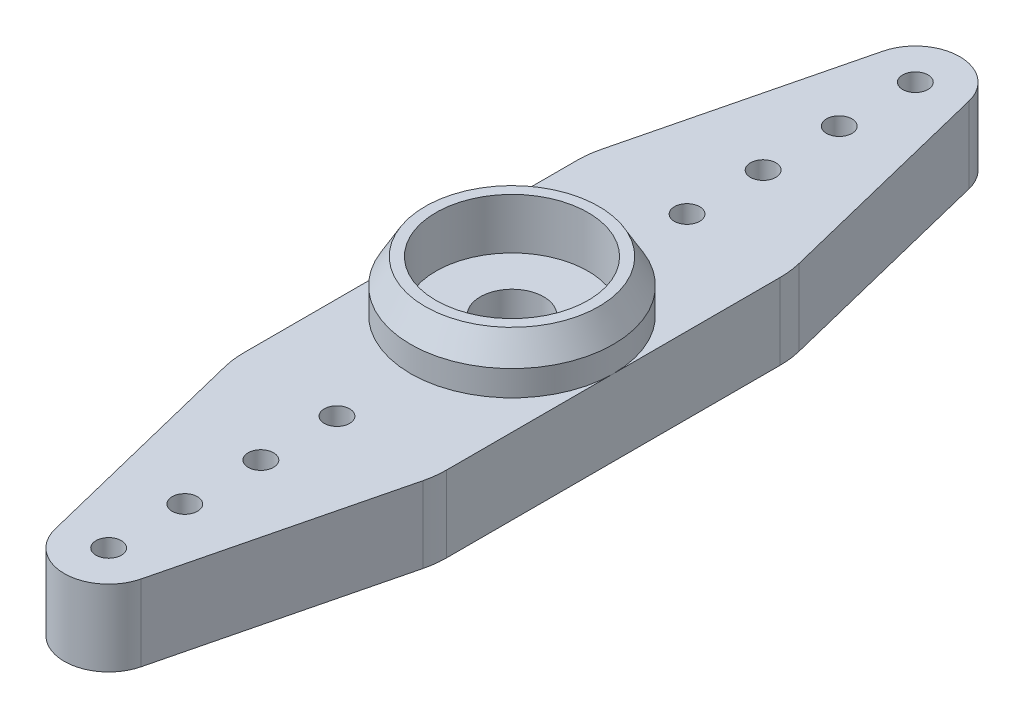
ISO-10303-21;
HEADER;
FILE_DESCRIPTION(('STEP AP214'),'2;1');
FILE_NAME('part.step','',(''),(''),'','','');
FILE_SCHEMA(('AUTOMOTIVE_DESIGN { 1 0 10303 214 1 1 1 1 }'));
ENDSEC;
DATA;
#1=APPLICATION_CONTEXT('core data for automotive mechanical design processes');
#2=APPLICATION_PROTOCOL_DEFINITION('international standard','automotive_design',2000,#1);
#3=PRODUCT_CONTEXT('',#1,'mechanical');
#4=PRODUCT('Part','Part','',(#3));
#5=PRODUCT_RELATED_PRODUCT_CATEGORY('part','',(#4));
#6=PRODUCT_DEFINITION_FORMATION('','',#4);
#7=PRODUCT_DEFINITION_CONTEXT('part definition',#1,'design');
#8=PRODUCT_DEFINITION('design','',#6,#7);
#9=PRODUCT_DEFINITION_SHAPE('','',#8);
#10=(LENGTH_UNIT() NAMED_UNIT(*) SI_UNIT(.MILLI.,.METRE.));
#11=(NAMED_UNIT(*) PLANE_ANGLE_UNIT() SI_UNIT($,.RADIAN.));
#12=(NAMED_UNIT(*) SI_UNIT($,.STERADIAN.) SOLID_ANGLE_UNIT());
#13=UNCERTAINTY_MEASURE_WITH_UNIT(LENGTH_MEASURE(1.E-05),#10,'distance_accuracy_value','');
#14=(GEOMETRIC_REPRESENTATION_CONTEXT(3) GLOBAL_UNCERTAINTY_ASSIGNED_CONTEXT((#13)) GLOBAL_UNIT_ASSIGNED_CONTEXT((#10,
#11,#12)) REPRESENTATION_CONTEXT('',''));
#15=CARTESIAN_POINT('',(0.,0.,0.));
#16=DIRECTION('',(0.,0.,1.));
#17=DIRECTION('',(1.,0.,0.));
#18=AXIS2_PLACEMENT_3D('',#15,#16,#17);
#19=CARTESIAN_POINT('',(0.,3.,0.));
#20=DIRECTION('',(0.,1.,0.));
#21=DIRECTION('',(0.,0.,1.));
#22=AXIS2_PLACEMENT_3D('',#19,#20,#21);
#23=PLANE('',#22);
#24=CARTESIAN_POINT('',(0.,3.,0.));
#25=DIRECTION('',(0.,1.,0.));
#26=DIRECTION('',(0.,0.,1.));
#27=AXIS2_PLACEMENT_3D('',#24,#25,#26);
#28=CIRCLE('',#27,4.);
#29=CARTESIAN_POINT('',(4.,3.,0.));
#30=VERTEX_POINT('',#29);
#31=CARTESIAN_POINT('',(-4.,3.,0.));
#32=VERTEX_POINT('',#31);
#33=EDGE_CURVE('E166',#30,#32,#28,.T.);
#34=ORIENTED_EDGE('',*,*,#33,.F.);
#35=DIRECTION('',(0.,0.,-1.));
#36=VECTOR('',#35,1.);
#37=CARTESIAN_POINT('',(4.,3.,-6.57429368146869));
#38=LINE('',#37,#36);
#39=CARTESIAN_POINT('',(4.,3.,-6.57429368146869));
#40=VERTEX_POINT('',#39);
#41=EDGE_CURVE('E94',#30,#40,#38,.T.);
#42=ORIENTED_EDGE('',*,*,#41,.T.);
#43=CARTESIAN_POINT('',(0.5,3.,-6.57429368146869));
#44=DIRECTION('',(0.,1.,0.));
#45=DIRECTION('',(0.,0.,-1.));
#46=AXIS2_PLACEMENT_3D('',#43,#44,#45);
#47=CIRCLE('',#46,3.5);
#48=CARTESIAN_POINT('',(3.89795205229431,3.,-7.41329418820803));
#49=VERTEX_POINT('',#48);
#50=EDGE_CURVE('E320',#40,#49,#47,.T.);
#51=ORIENTED_EDGE('',*,*,#50,.T.);
#52=DIRECTION('',(-0.239714430496953,0.,-0.970843443512661));
#53=VECTOR('',#52,1.);
#54=CARTESIAN_POINT('',(1.69897602614716,3.,-16.319147094104));
#55=LINE('',#54,#53);
#56=CARTESIAN_POINT('',(1.69897602614716,3.,-16.319147094104));
#57=VERTEX_POINT('',#56);
#58=EDGE_CURVE('E112',#49,#57,#55,.T.);
#59=ORIENTED_EDGE('',*,*,#58,.T.);
#60=CARTESIAN_POINT('',(0.,3.,-15.8996468407343));
#61=DIRECTION('',(0.,1.,0.));
#62=DIRECTION('',(0.,0.,-1.));
#63=AXIS2_PLACEMENT_3D('',#60,#61,#62);
#64=CIRCLE('',#63,1.75);
#65=CARTESIAN_POINT('',(-1.69897602614716,3.,-16.319147094104));
#66=VERTEX_POINT('',#65);
#67=EDGE_CURVE('E105',#57,#66,#64,.T.);
#68=ORIENTED_EDGE('',*,*,#67,.T.);
#69=DIRECTION('',(-0.239714430496953,0.,0.970843443512661));
#70=VECTOR('',#69,1.);
#71=CARTESIAN_POINT('',(-3.89795205229431,3.,-7.41329418820803));
#72=LINE('',#71,#70);
#73=CARTESIAN_POINT('',(-3.89795205229431,3.,-7.41329418820803));
#74=VERTEX_POINT('',#73);
#75=EDGE_CURVE('E109',#66,#74,#72,.T.);
#76=ORIENTED_EDGE('',*,*,#75,.T.);
#77=CARTESIAN_POINT('',(-0.5,3.,-6.57429368146869));
#78=DIRECTION('',(0.,1.,0.));
#79=DIRECTION('',(0.,0.,-1.));
#80=AXIS2_PLACEMENT_3D('',#77,#78,#79);
#81=CIRCLE('',#80,3.5);
#82=CARTESIAN_POINT('',(-4.,3.,-6.57429368146869));
#83=VERTEX_POINT('',#82);
#84=EDGE_CURVE('E59',#74,#83,#81,.T.);
#85=ORIENTED_EDGE('',*,*,#84,.T.);
#86=DIRECTION('',(0.,0.,1.));
#87=VECTOR('',#86,1.);
#88=CARTESIAN_POINT('',(-4.,3.,0.));
#89=LINE('',#88,#87);
#90=EDGE_CURVE('E133',#83,#32,#89,.T.);
#91=ORIENTED_EDGE('',*,*,#90,.T.);
#92=EDGE_LOOP('',(#34,#42,#51,#59,#68,#76,#85,#91));
#93=FACE_BOUND('',#92,.T.);
#94=CARTESIAN_POINT('',(0.,3.,-6.89964684073435));
#95=DIRECTION('',(0.,1.,0.));
#96=DIRECTION('',(0.,0.,1.));
#97=AXIS2_PLACEMENT_3D('',#94,#95,#96);
#98=CIRCLE('',#97,0.500000000000001);
#99=CARTESIAN_POINT('',(0.,3.,-6.39964684073434));
#100=VERTEX_POINT('',#99);
#101=EDGE_CURVE('E294',#100,#100,#98,.T.);
#102=ORIENTED_EDGE('',*,*,#101,.F.);
#103=EDGE_LOOP('',(#102));
#104=FACE_BOUND('',#103,.T.);
#105=CARTESIAN_POINT('',(0.,3.,-12.8996468407343));
#106=DIRECTION('',(0.,1.,0.));
#107=DIRECTION('',(0.,0.,1.));
#108=AXIS2_PLACEMENT_3D('',#105,#106,#107);
#109=CIRCLE('',#108,0.500000000000001);
#110=CARTESIAN_POINT('',(0.,3.,-12.3996468407343));
#111=VERTEX_POINT('',#110);
#112=EDGE_CURVE('E306',#111,#111,#109,.T.);
#113=ORIENTED_EDGE('',*,*,#112,.F.);
#114=EDGE_LOOP('',(#113));
#115=FACE_BOUND('',#114,.T.);
#116=CARTESIAN_POINT('',(0.,3.,-15.8996468407343));
#117=DIRECTION('',(0.,1.,0.));
#118=DIRECTION('',(0.,0.,1.));
#119=AXIS2_PLACEMENT_3D('',#116,#117,#118);
#120=CIRCLE('',#119,0.500000000000001);
#121=CARTESIAN_POINT('',(0.,3.,-15.3996468407343));
#122=VERTEX_POINT('',#121);
#123=EDGE_CURVE('E140',#122,#122,#120,.T.);
#124=ORIENTED_EDGE('',*,*,#123,.F.);
#125=EDGE_LOOP('',(#124));
#126=FACE_BOUND('',#125,.T.);
#127=CARTESIAN_POINT('',(0.,3.,-9.89964684073435));
#128=DIRECTION('',(0.,1.,0.));
#129=DIRECTION('',(0.,0.,1.));
#130=AXIS2_PLACEMENT_3D('',#127,#128,#129);
#131=CIRCLE('',#130,0.500000000000001);
#132=CARTESIAN_POINT('',(0.,3.,-9.39964684073435));
#133=VERTEX_POINT('',#132);
#134=EDGE_CURVE('E300',#133,#133,#131,.T.);
#135=ORIENTED_EDGE('',*,*,#134,.F.);
#136=EDGE_LOOP('',(#135));
#137=FACE_BOUND('',#136,.T.);
#138=ADVANCED_FACE('F35',(#93,#104,#115,#126,#137),#23,.T.);
#139=CARTESIAN_POINT('',(0.,3.,0.));
#140=DIRECTION('',(0.,-1.,0.));
#141=DIRECTION('',(0.,0.,1.));
#142=AXIS2_PLACEMENT_3D('',#139,#140,#141);
#143=CIRCLE('',#142,1.25);
#144=CARTESIAN_POINT('',(0.,3.,1.25));
#145=VERTEX_POINT('',#144);
#146=EDGE_CURVE('E153',#145,#145,#143,.T.);
#147=ORIENTED_EDGE('',*,*,#146,.T.);
#148=EDGE_LOOP('',(#147));
#149=FACE_BOUND('',#148,.T.);
#150=CARTESIAN_POINT('',(0.,3.,0.));
#151=DIRECTION('',(0.,1.,0.));
#152=DIRECTION('',(0.,0.,1.));
#153=AXIS2_PLACEMENT_3D('',#150,#151,#152);
#154=CIRCLE('',#153,3.);
#155=CARTESIAN_POINT('',(0.,3.,3.));
#156=VERTEX_POINT('',#155);
#157=EDGE_CURVE('E178',#156,#156,#154,.T.);
#158=ORIENTED_EDGE('',*,*,#157,.T.);
#159=EDGE_LOOP('',(#158));
#160=FACE_BOUND('',#159,.T.);
#161=ADVANCED_FACE('F185',(#149,#160),#23,.T.);
#162=EDGE_CURVE('E50',#32,#30,#28,.T.);
#163=ORIENTED_EDGE('',*,*,#162,.F.);
#164=CARTESIAN_POINT('',(-4.,3.,6.57429368146869));
#165=VERTEX_POINT('',#164);
#166=EDGE_CURVE('E129',#32,#165,#89,.T.);
#167=ORIENTED_EDGE('',*,*,#166,.T.);
#168=CARTESIAN_POINT('',(-0.5,3.,6.57429368146869));
#169=DIRECTION('',(0.,1.,0.));
#170=DIRECTION('',(0.,0.,1.));
#171=AXIS2_PLACEMENT_3D('',#168,#169,#170);
#172=CIRCLE('',#171,3.5);
#173=CARTESIAN_POINT('',(-3.89795205229431,3.,7.41329418820803));
#174=VERTEX_POINT('',#173);
#175=EDGE_CURVE('E246',#165,#174,#172,.T.);
#176=ORIENTED_EDGE('',*,*,#175,.T.);
#177=DIRECTION('',(0.239714430496953,0.,0.970843443512661));
#178=VECTOR('',#177,1.);
#179=CARTESIAN_POINT('',(-1.69897602614716,3.,16.319147094104));
#180=LINE('',#179,#178);
#181=CARTESIAN_POINT('',(-1.69897602614716,3.,16.319147094104));
#182=VERTEX_POINT('',#181);
#183=EDGE_CURVE('E249',#174,#182,#180,.T.);
#184=ORIENTED_EDGE('',*,*,#183,.T.);
#185=CARTESIAN_POINT('',(0.,3.,15.8996468407343));
#186=DIRECTION('',(0.,1.,0.));
#187=DIRECTION('',(0.,0.,1.));
#188=AXIS2_PLACEMENT_3D('',#185,#186,#187);
#189=CIRCLE('',#188,1.75);
#190=CARTESIAN_POINT('',(1.69897602614716,3.,16.319147094104));
#191=VERTEX_POINT('',#190);
#192=EDGE_CURVE('E253',#182,#191,#189,.T.);
#193=ORIENTED_EDGE('',*,*,#192,.T.);
#194=DIRECTION('',(0.239714430496953,0.,-0.970843443512661));
#195=VECTOR('',#194,1.);
#196=CARTESIAN_POINT('',(3.89795205229431,3.,7.41329418820803));
#197=LINE('',#196,#195);
#198=CARTESIAN_POINT('',(3.89795205229431,3.,7.41329418820803));
#199=VERTEX_POINT('',#198);
#200=EDGE_CURVE('E256',#191,#199,#197,.T.);
#201=ORIENTED_EDGE('',*,*,#200,.T.);
#202=CARTESIAN_POINT('',(0.5,3.,6.57429368146869));
#203=DIRECTION('',(0.,1.,0.));
#204=DIRECTION('',(0.,0.,1.));
#205=AXIS2_PLACEMENT_3D('',#202,#203,#204);
#206=CIRCLE('',#205,3.5);
#207=CARTESIAN_POINT('',(4.,3.,6.57429368146869));
#208=VERTEX_POINT('',#207);
#209=EDGE_CURVE('E259',#199,#208,#206,.T.);
#210=ORIENTED_EDGE('',*,*,#209,.T.);
#211=EDGE_CURVE('E318',#208,#30,#38,.T.);
#212=ORIENTED_EDGE('',*,*,#211,.T.);
#213=EDGE_LOOP('',(#163,#167,#176,#184,#193,#201,#210,#212));
#214=FACE_BOUND('',#213,.T.);
#215=CARTESIAN_POINT('',(0.,3.,9.89964684073435));
#216=DIRECTION('',(0.,1.,0.));
#217=DIRECTION('',(0.,0.,-1.));
#218=AXIS2_PLACEMENT_3D('',#215,#216,#217);
#219=CIRCLE('',#218,0.500000000000001);
#220=CARTESIAN_POINT('',(0.,3.,9.39964684073435));
#221=VERTEX_POINT('',#220);
#222=EDGE_CURVE('E220',#221,#221,#219,.T.);
#223=ORIENTED_EDGE('',*,*,#222,.F.);
#224=EDGE_LOOP('',(#223));
#225=FACE_BOUND('',#224,.T.);
#226=CARTESIAN_POINT('',(0.,3.,15.8996468407343));
#227=DIRECTION('',(0.,1.,0.));
#228=DIRECTION('',(0.,0.,-1.));
#229=AXIS2_PLACEMENT_3D('',#226,#227,#228);
#230=CIRCLE('',#229,0.500000000000001);
#231=CARTESIAN_POINT('',(0.,3.,15.3996468407343));
#232=VERTEX_POINT('',#231);
#233=EDGE_CURVE('E224',#232,#232,#230,.T.);
#234=ORIENTED_EDGE('',*,*,#233,.F.);
#235=EDGE_LOOP('',(#234));
#236=FACE_BOUND('',#235,.T.);
#237=CARTESIAN_POINT('',(0.,3.,12.8996468407343));
#238=DIRECTION('',(0.,1.,0.));
#239=DIRECTION('',(0.,0.,-1.));
#240=AXIS2_PLACEMENT_3D('',#237,#238,#239);
#241=CIRCLE('',#240,0.500000000000001);
#242=CARTESIAN_POINT('',(0.,3.,12.3996468407343));
#243=VERTEX_POINT('',#242);
#244=EDGE_CURVE('E228',#243,#243,#241,.T.);
#245=ORIENTED_EDGE('',*,*,#244,.F.);
#246=EDGE_LOOP('',(#245));
#247=FACE_BOUND('',#246,.T.);
#248=CARTESIAN_POINT('',(0.,3.,6.89964684073435));
#249=DIRECTION('',(0.,1.,0.));
#250=DIRECTION('',(0.,0.,-1.));
#251=AXIS2_PLACEMENT_3D('',#248,#249,#250);
#252=CIRCLE('',#251,0.500000000000001);
#253=CARTESIAN_POINT('',(0.,3.,6.39964684073434));
#254=VERTEX_POINT('',#253);
#255=EDGE_CURVE('E175',#254,#254,#252,.T.);
#256=ORIENTED_EDGE('',*,*,#255,.F.);
#257=EDGE_LOOP('',(#256));
#258=FACE_BOUND('',#257,.T.);
#259=ADVANCED_FACE('F202',(#214,#225,#236,#247,#258),#23,.T.);
#260=CARTESIAN_POINT('',(0.,0.,0.));
#261=DIRECTION('',(0.,1.,0.));
#262=DIRECTION('',(0.,0.,1.));
#263=AXIS2_PLACEMENT_3D('',#260,#261,#262);
#264=PLANE('',#263);
#265=CARTESIAN_POINT('',(0.,0.,0.));
#266=DIRECTION('',(0.,-1.,0.));
#267=DIRECTION('',(0.,0.,1.));
#268=AXIS2_PLACEMENT_3D('',#265,#266,#267);
#269=CIRCLE('',#268,1.25);
#270=CARTESIAN_POINT('',(0.,0.,1.25));
#271=VERTEX_POINT('',#270);
#272=EDGE_CURVE('E136',#271,#271,#269,.T.);
#273=ORIENTED_EDGE('',*,*,#272,.F.);
#274=EDGE_LOOP('',(#273));
#275=FACE_BOUND('',#274,.T.);
#276=CARTESIAN_POINT('',(-0.5,0.,6.57429368146869));
#277=DIRECTION('',(0.,1.,0.));
#278=DIRECTION('',(0.,0.,1.));
#279=AXIS2_PLACEMENT_3D('',#276,#277,#278);
#280=CIRCLE('',#279,3.5);
#281=CARTESIAN_POINT('',(-4.,0.,6.57429368146869));
#282=VERTEX_POINT('',#281);
#283=CARTESIAN_POINT('',(-3.89795205229431,0.,7.41329418820803));
#284=VERTEX_POINT('',#283);
#285=EDGE_CURVE('E243',#282,#284,#280,.T.);
#286=ORIENTED_EDGE('',*,*,#285,.F.);
#287=DIRECTION('',(0.,0.,1.));
#288=VECTOR('',#287,1.);
#289=CARTESIAN_POINT('',(-4.,0.,0.));
#290=LINE('',#289,#288);
#291=CARTESIAN_POINT('',(-4.,0.,-6.57429368146869));
#292=VERTEX_POINT('',#291);
#293=EDGE_CURVE('E150',#292,#282,#290,.T.);
#294=ORIENTED_EDGE('',*,*,#293,.F.);
#295=CARTESIAN_POINT('',(-0.5,0.,-6.57429368146869));
#296=DIRECTION('',(0.,1.,0.));
#297=DIRECTION('',(0.,0.,-1.));
#298=AXIS2_PLACEMENT_3D('',#295,#296,#297);
#299=CIRCLE('',#298,3.5);
#300=CARTESIAN_POINT('',(-3.89795205229431,0.,-7.41329418820803));
#301=VERTEX_POINT('',#300);
#302=EDGE_CURVE('E86',#301,#292,#299,.T.);
#303=ORIENTED_EDGE('',*,*,#302,.F.);
#304=DIRECTION('',(-0.239714430496953,0.,0.970843443512661));
#305=VECTOR('',#304,1.);
#306=CARTESIAN_POINT('',(-3.89795205229431,0.,-7.41329418820803));
#307=LINE('',#306,#305);
#308=CARTESIAN_POINT('',(-1.69897602614716,0.,-16.319147094104));
#309=VERTEX_POINT('',#308);
#310=EDGE_CURVE('E147',#309,#301,#307,.T.);
#311=ORIENTED_EDGE('',*,*,#310,.F.);
#312=CARTESIAN_POINT('',(0.,0.,-15.8996468407343));
#313=DIRECTION('',(0.,1.,0.));
#314=DIRECTION('',(0.,0.,-1.));
#315=AXIS2_PLACEMENT_3D('',#312,#313,#314);
#316=CIRCLE('',#315,1.75);
#317=CARTESIAN_POINT('',(1.69897602614716,0.,-16.319147094104));
#318=VERTEX_POINT('',#317);
#319=EDGE_CURVE('E121',#318,#309,#316,.T.);
#320=ORIENTED_EDGE('',*,*,#319,.F.);
#321=DIRECTION('',(-0.239714430496953,0.,-0.970843443512661));
#322=VECTOR('',#321,1.);
#323=CARTESIAN_POINT('',(1.69897602614716,0.,-16.319147094104));
#324=LINE('',#323,#322);
#325=CARTESIAN_POINT('',(3.89795205229431,0.,-7.41329418820803));
#326=VERTEX_POINT('',#325);
#327=EDGE_CURVE('E144',#326,#318,#324,.T.);
#328=ORIENTED_EDGE('',*,*,#327,.F.);
#329=CARTESIAN_POINT('',(0.5,0.,-6.57429368146869));
#330=DIRECTION('',(0.,1.,0.));
#331=DIRECTION('',(0.,0.,-1.));
#332=AXIS2_PLACEMENT_3D('',#329,#330,#331);
#333=CIRCLE('',#332,3.5);
#334=CARTESIAN_POINT('',(4.,0.,-6.57429368146869));
#335=VERTEX_POINT('',#334);
#336=EDGE_CURVE('E142',#335,#326,#333,.T.);
#337=ORIENTED_EDGE('',*,*,#336,.F.);
#338=DIRECTION('',(0.,0.,-1.));
#339=VECTOR('',#338,1.);
#340=CARTESIAN_POINT('',(4.,0.,-6.57429368146869));
#341=LINE('',#340,#339);
#342=CARTESIAN_POINT('',(4.,0.,6.57429368146869));
#343=VERTEX_POINT('',#342);
#344=EDGE_CURVE('E139',#343,#335,#341,.T.);
#345=ORIENTED_EDGE('',*,*,#344,.F.);
#346=CARTESIAN_POINT('',(0.5,0.,6.57429368146869));
#347=DIRECTION('',(0.,1.,0.));
#348=DIRECTION('',(0.,0.,1.));
#349=AXIS2_PLACEMENT_3D('',#346,#347,#348);
#350=CIRCLE('',#349,3.5);
#351=CARTESIAN_POINT('',(3.89795205229431,0.,7.41329418820803));
#352=VERTEX_POINT('',#351);
#353=EDGE_CURVE('E250',#352,#343,#350,.T.);
#354=ORIENTED_EDGE('',*,*,#353,.F.);
#355=DIRECTION('',(0.239714430496953,0.,-0.970843443512661));
#356=VECTOR('',#355,1.);
#357=CARTESIAN_POINT('',(3.89795205229431,0.,7.41329418820803));
#358=LINE('',#357,#356);
#359=CARTESIAN_POINT('',(1.69897602614716,0.,16.319147094104));
#360=VERTEX_POINT('',#359);
#361=EDGE_CURVE('E271',#360,#352,#358,.T.);
#362=ORIENTED_EDGE('',*,*,#361,.F.);
#363=CARTESIAN_POINT('',(0.,0.,15.8996468407343));
#364=DIRECTION('',(0.,1.,0.));
#365=DIRECTION('',(0.,0.,1.));
#366=AXIS2_PLACEMENT_3D('',#363,#364,#365);
#367=CIRCLE('',#366,1.75);
#368=CARTESIAN_POINT('',(-1.69897602614716,0.,16.319147094104));
#369=VERTEX_POINT('',#368);
#370=EDGE_CURVE('E268',#369,#360,#367,.T.);
#371=ORIENTED_EDGE('',*,*,#370,.F.);
#372=DIRECTION('',(0.239714430496953,0.,0.970843443512661));
#373=VECTOR('',#372,1.);
#374=CARTESIAN_POINT('',(-1.69897602614716,0.,16.319147094104));
#375=LINE('',#374,#373);
#376=EDGE_CURVE('E265',#284,#369,#375,.T.);
#377=ORIENTED_EDGE('',*,*,#376,.F.);
#378=EDGE_LOOP('',(#286,#294,#303,#311,#320,#328,#337,#345,#354,#362,#371,#377));
#379=FACE_BOUND('',#378,.T.);
#380=CARTESIAN_POINT('',(0.,0.,-15.8996468407343));
#381=DIRECTION('',(0.,1.,0.));
#382=DIRECTION('',(0.,0.,1.));
#383=AXIS2_PLACEMENT_3D('',#380,#381,#382);
#384=CIRCLE('',#383,0.500000000000001);
#385=CARTESIAN_POINT('',(0.,0.,-15.3996468407343));
#386=VERTEX_POINT('',#385);
#387=EDGE_CURVE('E309',#386,#386,#384,.T.);
#388=ORIENTED_EDGE('',*,*,#387,.T.);
#389=EDGE_LOOP('',(#388));
#390=FACE_BOUND('',#389,.T.);
#391=CARTESIAN_POINT('',(0.,0.,-12.8996468407343));
#392=DIRECTION('',(0.,1.,0.));
#393=DIRECTION('',(0.,0.,1.));
#394=AXIS2_PLACEMENT_3D('',#391,#392,#393);
#395=CIRCLE('',#394,0.500000000000001);
#396=CARTESIAN_POINT('',(0.,0.,-12.3996468407343));
#397=VERTEX_POINT('',#396);
#398=EDGE_CURVE('E303',#397,#397,#395,.T.);
#399=ORIENTED_EDGE('',*,*,#398,.T.);
#400=EDGE_LOOP('',(#399));
#401=FACE_BOUND('',#400,.T.);
#402=CARTESIAN_POINT('',(0.,0.,-9.89964684073435));
#403=DIRECTION('',(0.,1.,0.));
#404=DIRECTION('',(0.,0.,1.));
#405=AXIS2_PLACEMENT_3D('',#402,#403,#404);
#406=CIRCLE('',#405,0.500000000000001);
#407=CARTESIAN_POINT('',(0.,0.,-9.39964684073435));
#408=VERTEX_POINT('',#407);
#409=EDGE_CURVE('E297',#408,#408,#406,.T.);
#410=ORIENTED_EDGE('',*,*,#409,.T.);
#411=EDGE_LOOP('',(#410));
#412=FACE_BOUND('',#411,.T.);
#413=CARTESIAN_POINT('',(0.,0.,-6.89964684073435));
#414=DIRECTION('',(0.,1.,0.));
#415=DIRECTION('',(0.,0.,1.));
#416=AXIS2_PLACEMENT_3D('',#413,#414,#415);
#417=CIRCLE('',#416,0.500000000000001);
#418=CARTESIAN_POINT('',(0.,0.,-6.39964684073434));
#419=VERTEX_POINT('',#418);
#420=EDGE_CURVE('E293',#419,#419,#417,.T.);
#421=ORIENTED_EDGE('',*,*,#420,.T.);
#422=EDGE_LOOP('',(#421));
#423=FACE_BOUND('',#422,.T.);
#424=CARTESIAN_POINT('',(0.,0.,15.8996468407343));
#425=DIRECTION('',(0.,1.,0.));
#426=DIRECTION('',(0.,0.,-1.));
#427=AXIS2_PLACEMENT_3D('',#424,#425,#426);
#428=CIRCLE('',#427,0.500000000000001);
#429=CARTESIAN_POINT('',(0.,0.,15.3996468407343));
#430=VERTEX_POINT('',#429);
#431=EDGE_CURVE('E239',#430,#430,#428,.T.);
#432=ORIENTED_EDGE('',*,*,#431,.T.);
#433=EDGE_LOOP('',(#432));
#434=FACE_BOUND('',#433,.T.);
#435=CARTESIAN_POINT('',(0.,0.,12.8996468407343));
#436=DIRECTION('',(0.,1.,0.));
#437=DIRECTION('',(0.,0.,-1.));
#438=AXIS2_PLACEMENT_3D('',#435,#436,#437);
#439=CIRCLE('',#438,0.500000000000001);
#440=CARTESIAN_POINT('',(0.,0.,12.3996468407343));
#441=VERTEX_POINT('',#440);
#442=EDGE_CURVE('E236',#441,#441,#439,.T.);
#443=ORIENTED_EDGE('',*,*,#442,.T.);
#444=EDGE_LOOP('',(#443));
#445=FACE_BOUND('',#444,.T.);
#446=CARTESIAN_POINT('',(0.,0.,9.89964684073435));
#447=DIRECTION('',(0.,1.,0.));
#448=DIRECTION('',(0.,0.,-1.));
#449=AXIS2_PLACEMENT_3D('',#446,#447,#448);
#450=CIRCLE('',#449,0.500000000000001);
#451=CARTESIAN_POINT('',(0.,0.,9.39964684073435));
#452=VERTEX_POINT('',#451);
#453=EDGE_CURVE('E232',#452,#452,#450,.T.);
#454=ORIENTED_EDGE('',*,*,#453,.T.);
#455=EDGE_LOOP('',(#454));
#456=FACE_BOUND('',#455,.T.);
#457=CARTESIAN_POINT('',(0.,0.,6.89964684073435));
#458=DIRECTION('',(0.,1.,0.));
#459=DIRECTION('',(0.,0.,-1.));
#460=AXIS2_PLACEMENT_3D('',#457,#458,#459);
#461=CIRCLE('',#460,0.500000000000001);
#462=CARTESIAN_POINT('',(0.,0.,6.39964684073434));
#463=VERTEX_POINT('',#462);
#464=EDGE_CURVE('E172',#463,#463,#461,.T.);
#465=ORIENTED_EDGE('',*,*,#464,.T.);
#466=EDGE_LOOP('',(#465));
#467=FACE_BOUND('',#466,.T.);
#468=ADVANCED_FACE('F210',(#275,#379,#390,#401,#412,#423,#434,#445,#456,#467),#264,.F.);
#469=CARTESIAN_POINT('',(0.,3.,0.));
#470=DIRECTION('',(0.,-1.,0.));
#471=DIRECTION('',(0.,0.,-1.));
#472=AXIS2_PLACEMENT_3D('',#469,#470,#471);
#473=CYLINDRICAL_SURFACE('',#472,1.25);
#474=ORIENTED_EDGE('',*,*,#272,.T.);
#475=EDGE_LOOP('',(#474));
#476=FACE_BOUND('',#475,.T.);
#477=ORIENTED_EDGE('',*,*,#146,.F.);
#478=EDGE_LOOP('',(#477));
#479=FACE_BOUND('',#478,.T.);
#480=ADVANCED_FACE('F214',(#476,#479),#473,.F.);
#481=CARTESIAN_POINT('',(4.,3.,-6.57429368146869));
#482=DIRECTION('',(-1.,0.,0.));
#483=DIRECTION('',(0.,0.,1.));
#484=AXIS2_PLACEMENT_3D('',#481,#482,#483);
#485=PLANE('',#484);
#486=ORIENTED_EDGE('',*,*,#344,.T.);
#487=DIRECTION('',(0.,-1.,0.));
#488=VECTOR('',#487,1.);
#489=CARTESIAN_POINT('',(4.,3.,-6.57429368146869));
#490=LINE('',#489,#488);
#491=EDGE_CURVE('E160',#40,#335,#490,.T.);
#492=ORIENTED_EDGE('',*,*,#491,.F.);
#493=ORIENTED_EDGE('',*,*,#41,.F.);
#494=ORIENTED_EDGE('',*,*,#211,.F.);
#495=DIRECTION('',(0.,-1.,0.));
#496=VECTOR('',#495,1.);
#497=CARTESIAN_POINT('',(4.,3.,6.57429368146869));
#498=LINE('',#497,#496);
#499=EDGE_CURVE('E262',#208,#343,#498,.T.);
#500=ORIENTED_EDGE('',*,*,#499,.T.);
#501=EDGE_LOOP('',(#486,#492,#493,#494,#500));
#502=FACE_BOUND('',#501,.T.);
#503=ADVANCED_FACE('F370',(#502),#485,.F.);
#504=CARTESIAN_POINT('',(0.5,3.,-6.57429368146869));
#505=DIRECTION('',(0.,-1.,0.));
#506=DIRECTION('',(0.,0.,-1.));
#507=AXIS2_PLACEMENT_3D('',#504,#505,#506);
#508=CYLINDRICAL_SURFACE('',#507,3.5);
#509=ORIENTED_EDGE('',*,*,#336,.T.);
#510=DIRECTION('',(0.,-1.,0.));
#511=VECTOR('',#510,1.);
#512=CARTESIAN_POINT('',(3.89795205229431,3.,-7.41329418820803));
#513=LINE('',#512,#511);
#514=EDGE_CURVE('E157',#49,#326,#513,.T.);
#515=ORIENTED_EDGE('',*,*,#514,.F.);
#516=ORIENTED_EDGE('',*,*,#50,.F.);
#517=ORIENTED_EDGE('',*,*,#491,.T.);
#518=EDGE_LOOP('',(#509,#515,#516,#517));
#519=FACE_BOUND('',#518,.T.);
#520=ADVANCED_FACE('F324',(#519),#508,.T.);
#521=CARTESIAN_POINT('',(1.69897602614716,3.,-16.319147094104));
#522=DIRECTION('',(-0.970843443512661,0.,0.239714430496953));
#523=DIRECTION('',(0.239714430496953,0.,0.970843443512661));
#524=AXIS2_PLACEMENT_3D('',#521,#522,#523);
#525=PLANE('',#524);
#526=ORIENTED_EDGE('',*,*,#327,.T.);
#527=DIRECTION('',(0.,-1.,0.));
#528=VECTOR('',#527,1.);
#529=CARTESIAN_POINT('',(1.69897602614716,3.,-16.319147094104));
#530=LINE('',#529,#528);
#531=EDGE_CURVE('E124',#57,#318,#530,.T.);
#532=ORIENTED_EDGE('',*,*,#531,.F.);
#533=ORIENTED_EDGE('',*,*,#58,.F.);
#534=ORIENTED_EDGE('',*,*,#514,.T.);
#535=EDGE_LOOP('',(#526,#532,#533,#534));
#536=FACE_BOUND('',#535,.T.);
#537=ADVANCED_FACE('F328',(#536),#525,.F.);
#538=CARTESIAN_POINT('',(0.,3.,-15.8996468407343));
#539=DIRECTION('',(0.,-1.,0.));
#540=DIRECTION('',(0.,0.,-1.));
#541=AXIS2_PLACEMENT_3D('',#538,#539,#540);
#542=CYLINDRICAL_SURFACE('',#541,1.75);
#543=ORIENTED_EDGE('',*,*,#319,.T.);
#544=DIRECTION('',(0.,-1.,0.));
#545=VECTOR('',#544,1.);
#546=CARTESIAN_POINT('',(-1.69897602614716,3.,-16.319147094104));
#547=LINE('',#546,#545);
#548=EDGE_CURVE('E118',#66,#309,#547,.T.);
#549=ORIENTED_EDGE('',*,*,#548,.F.);
#550=ORIENTED_EDGE('',*,*,#67,.F.);
#551=ORIENTED_EDGE('',*,*,#531,.T.);
#552=EDGE_LOOP('',(#543,#549,#550,#551));
#553=FACE_BOUND('',#552,.T.);
#554=ADVANCED_FACE('F119',(#553),#542,.T.);
#555=CARTESIAN_POINT('',(-3.89795205229431,3.,-7.41329418820803));
#556=DIRECTION('',(0.970843443512661,0.,0.239714430496953));
#557=DIRECTION('',(0.239714430496953,0.,-0.970843443512661));
#558=AXIS2_PLACEMENT_3D('',#555,#556,#557);
#559=PLANE('',#558);
#560=ORIENTED_EDGE('',*,*,#310,.T.);
#561=DIRECTION('',(0.,-1.,0.));
#562=VECTOR('',#561,1.);
#563=CARTESIAN_POINT('',(-3.89795205229431,3.,-7.41329418820803));
#564=LINE('',#563,#562);
#565=EDGE_CURVE('E125',#74,#301,#564,.T.);
#566=ORIENTED_EDGE('',*,*,#565,.F.);
#567=ORIENTED_EDGE('',*,*,#75,.F.);
#568=ORIENTED_EDGE('',*,*,#548,.T.);
#569=EDGE_LOOP('',(#560,#566,#567,#568));
#570=FACE_BOUND('',#569,.T.);
#571=ADVANCED_FACE('F127',(#570),#559,.F.);
#572=CARTESIAN_POINT('',(-0.5,3.,-6.57429368146869));
#573=DIRECTION('',(0.,-1.,0.));
#574=DIRECTION('',(0.,0.,-1.));
#575=AXIS2_PLACEMENT_3D('',#572,#573,#574);
#576=CYLINDRICAL_SURFACE('',#575,3.5);
#577=ORIENTED_EDGE('',*,*,#302,.T.);
#578=DIRECTION('',(0.,-1.,0.));
#579=VECTOR('',#578,1.);
#580=CARTESIAN_POINT('',(-4.,3.,-6.57429368146869));
#581=LINE('',#580,#579);
#582=EDGE_CURVE('E135',#83,#292,#581,.T.);
#583=ORIENTED_EDGE('',*,*,#582,.F.);
#584=ORIENTED_EDGE('',*,*,#84,.F.);
#585=ORIENTED_EDGE('',*,*,#565,.T.);
#586=EDGE_LOOP('',(#577,#583,#584,#585));
#587=FACE_BOUND('',#586,.T.);
#588=ADVANCED_FACE('F333',(#587),#576,.T.);
#589=CARTESIAN_POINT('',(-4.,3.,0.));
#590=DIRECTION('',(1.,0.,0.));
#591=DIRECTION('',(0.,0.,-1.));
#592=AXIS2_PLACEMENT_3D('',#589,#590,#591);
#593=PLANE('',#592);
#594=ORIENTED_EDGE('',*,*,#293,.T.);
#595=DIRECTION('',(0.,-1.,0.));
#596=VECTOR('',#595,1.);
#597=CARTESIAN_POINT('',(-4.,3.,6.57429368146869));
#598=LINE('',#597,#596);
#599=EDGE_CURVE('E290',#165,#282,#598,.T.);
#600=ORIENTED_EDGE('',*,*,#599,.F.);
#601=ORIENTED_EDGE('',*,*,#166,.F.);
#602=ORIENTED_EDGE('',*,*,#90,.F.);
#603=ORIENTED_EDGE('',*,*,#582,.T.);
#604=EDGE_LOOP('',(#594,#600,#601,#602,#603));
#605=FACE_BOUND('',#604,.T.);
#606=ADVANCED_FACE('F336',(#605),#593,.F.);
#607=CARTESIAN_POINT('',(0.,3.,-15.8996468407343));
#608=DIRECTION('',(0.,-1.,0.));
#609=DIRECTION('',(0.,0.,-1.));
#610=AXIS2_PLACEMENT_3D('',#607,#608,#609);
#611=CYLINDRICAL_SURFACE('',#610,0.500000000000001);
#612=ORIENTED_EDGE('',*,*,#123,.T.);
#613=EDGE_LOOP('',(#612));
#614=FACE_BOUND('',#613,.T.);
#615=ORIENTED_EDGE('',*,*,#387,.F.);
#616=EDGE_LOOP('',(#615));
#617=FACE_BOUND('',#616,.T.);
#618=ADVANCED_FACE('F406',(#614,#617),#611,.F.);
#619=CARTESIAN_POINT('',(0.,3.,-12.8996468407343));
#620=DIRECTION('',(0.,-1.,0.));
#621=DIRECTION('',(0.,0.,-1.));
#622=AXIS2_PLACEMENT_3D('',#619,#620,#621);
#623=CYLINDRICAL_SURFACE('',#622,0.500000000000001);
#624=ORIENTED_EDGE('',*,*,#112,.T.);
#625=EDGE_LOOP('',(#624));
#626=FACE_BOUND('',#625,.T.);
#627=ORIENTED_EDGE('',*,*,#398,.F.);
#628=EDGE_LOOP('',(#627));
#629=FACE_BOUND('',#628,.T.);
#630=ADVANCED_FACE('F403',(#626,#629),#623,.F.);
#631=CARTESIAN_POINT('',(0.,3.,-9.89964684073435));
#632=DIRECTION('',(0.,-1.,0.));
#633=DIRECTION('',(0.,0.,-1.));
#634=AXIS2_PLACEMENT_3D('',#631,#632,#633);
#635=CYLINDRICAL_SURFACE('',#634,0.500000000000001);
#636=ORIENTED_EDGE('',*,*,#134,.T.);
#637=EDGE_LOOP('',(#636));
#638=FACE_BOUND('',#637,.T.);
#639=ORIENTED_EDGE('',*,*,#409,.F.);
#640=EDGE_LOOP('',(#639));
#641=FACE_BOUND('',#640,.T.);
#642=ADVANCED_FACE('F399',(#638,#641),#635,.F.);
#643=CARTESIAN_POINT('',(0.,3.,-6.89964684073435));
#644=DIRECTION('',(0.,-1.,0.));
#645=DIRECTION('',(0.,0.,-1.));
#646=AXIS2_PLACEMENT_3D('',#643,#644,#645);
#647=CYLINDRICAL_SURFACE('',#646,0.500000000000001);
#648=ORIENTED_EDGE('',*,*,#101,.T.);
#649=EDGE_LOOP('',(#648));
#650=FACE_BOUND('',#649,.T.);
#651=ORIENTED_EDGE('',*,*,#420,.F.);
#652=EDGE_LOOP('',(#651));
#653=FACE_BOUND('',#652,.T.);
#654=ADVANCED_FACE('F395',(#650,#653),#647,.F.);
#655=CARTESIAN_POINT('',(-0.5,3.,6.57429368146869));
#656=DIRECTION('',(0.,-1.,0.));
#657=DIRECTION('',(0.,0.,-1.));
#658=AXIS2_PLACEMENT_3D('',#655,#656,#657);
#659=CYLINDRICAL_SURFACE('',#658,3.5);
#660=ORIENTED_EDGE('',*,*,#285,.T.);
#661=DIRECTION('',(0.,-1.,0.));
#662=VECTOR('',#661,1.);
#663=CARTESIAN_POINT('',(-3.89795205229431,3.,7.41329418820803));
#664=LINE('',#663,#662);
#665=EDGE_CURVE('E287',#174,#284,#664,.T.);
#666=ORIENTED_EDGE('',*,*,#665,.F.);
#667=ORIENTED_EDGE('',*,*,#175,.F.);
#668=ORIENTED_EDGE('',*,*,#599,.T.);
#669=EDGE_LOOP('',(#660,#666,#667,#668));
#670=FACE_BOUND('',#669,.T.);
#671=ADVANCED_FACE('F391',(#670),#659,.T.);
#672=CARTESIAN_POINT('',(-1.69897602614716,3.,16.319147094104));
#673=DIRECTION('',(0.970843443512661,0.,-0.239714430496953));
#674=DIRECTION('',(-0.239714430496953,0.,-0.970843443512661));
#675=AXIS2_PLACEMENT_3D('',#672,#673,#674);
#676=PLANE('',#675);
#677=ORIENTED_EDGE('',*,*,#376,.T.);
#678=DIRECTION('',(0.,-1.,0.));
#679=VECTOR('',#678,1.);
#680=CARTESIAN_POINT('',(-1.69897602614716,3.,16.319147094104));
#681=LINE('',#680,#679);
#682=EDGE_CURVE('E284',#182,#369,#681,.T.);
#683=ORIENTED_EDGE('',*,*,#682,.F.);
#684=ORIENTED_EDGE('',*,*,#183,.F.);
#685=ORIENTED_EDGE('',*,*,#665,.T.);
#686=EDGE_LOOP('',(#677,#683,#684,#685));
#687=FACE_BOUND('',#686,.T.);
#688=ADVANCED_FACE('F384',(#687),#676,.F.);
#689=CARTESIAN_POINT('',(0.,3.,15.8996468407343));
#690=DIRECTION('',(0.,-1.,0.));
#691=DIRECTION('',(0.,0.,-1.));
#692=AXIS2_PLACEMENT_3D('',#689,#690,#691);
#693=CYLINDRICAL_SURFACE('',#692,1.75);
#694=ORIENTED_EDGE('',*,*,#370,.T.);
#695=DIRECTION('',(0.,-1.,0.));
#696=VECTOR('',#695,1.);
#697=CARTESIAN_POINT('',(1.69897602614716,3.,16.319147094104));
#698=LINE('',#697,#696);
#699=EDGE_CURVE('E281',#191,#360,#698,.T.);
#700=ORIENTED_EDGE('',*,*,#699,.F.);
#701=ORIENTED_EDGE('',*,*,#192,.F.);
#702=ORIENTED_EDGE('',*,*,#682,.T.);
#703=EDGE_LOOP('',(#694,#700,#701,#702));
#704=FACE_BOUND('',#703,.T.);
#705=ADVANCED_FACE('F376',(#704),#693,.T.);
#706=CARTESIAN_POINT('',(3.89795205229431,3.,7.41329418820803));
#707=DIRECTION('',(-0.970843443512661,0.,-0.239714430496953));
#708=DIRECTION('',(-0.239714430496953,0.,0.970843443512661));
#709=AXIS2_PLACEMENT_3D('',#706,#707,#708);
#710=PLANE('',#709);
#711=ORIENTED_EDGE('',*,*,#361,.T.);
#712=DIRECTION('',(0.,-1.,0.));
#713=VECTOR('',#712,1.);
#714=CARTESIAN_POINT('',(3.89795205229431,3.,7.41329418820803));
#715=LINE('',#714,#713);
#716=EDGE_CURVE('E278',#199,#352,#715,.T.);
#717=ORIENTED_EDGE('',*,*,#716,.F.);
#718=ORIENTED_EDGE('',*,*,#200,.F.);
#719=ORIENTED_EDGE('',*,*,#699,.T.);
#720=EDGE_LOOP('',(#711,#717,#718,#719));
#721=FACE_BOUND('',#720,.T.);
#722=ADVANCED_FACE('F374',(#721),#710,.F.);
#723=CARTESIAN_POINT('',(0.5,3.,6.57429368146869));
#724=DIRECTION('',(0.,-1.,0.));
#725=DIRECTION('',(0.,0.,-1.));
#726=AXIS2_PLACEMENT_3D('',#723,#724,#725);
#727=CYLINDRICAL_SURFACE('',#726,3.5);
#728=ORIENTED_EDGE('',*,*,#353,.T.);
#729=ORIENTED_EDGE('',*,*,#499,.F.);
#730=ORIENTED_EDGE('',*,*,#209,.F.);
#731=ORIENTED_EDGE('',*,*,#716,.T.);
#732=EDGE_LOOP('',(#728,#729,#730,#731));
#733=FACE_BOUND('',#732,.T.);
#734=ADVANCED_FACE('F368',(#733),#727,.T.);
#735=CARTESIAN_POINT('',(0.,3.,15.8996468407343));
#736=DIRECTION('',(0.,-1.,0.));
#737=DIRECTION('',(0.,0.,-1.));
#738=AXIS2_PLACEMENT_3D('',#735,#736,#737);
#739=CYLINDRICAL_SURFACE('',#738,0.500000000000001);
#740=ORIENTED_EDGE('',*,*,#233,.T.);
#741=EDGE_LOOP('',(#740));
#742=FACE_BOUND('',#741,.T.);
#743=ORIENTED_EDGE('',*,*,#431,.F.);
#744=EDGE_LOOP('',(#743));
#745=FACE_BOUND('',#744,.T.);
#746=ADVANCED_FACE('F382',(#742,#745),#739,.F.);
#747=CARTESIAN_POINT('',(0.,3.,12.8996468407343));
#748=DIRECTION('',(0.,-1.,0.));
#749=DIRECTION('',(0.,0.,-1.));
#750=AXIS2_PLACEMENT_3D('',#747,#748,#749);
#751=CYLINDRICAL_SURFACE('',#750,0.500000000000001);
#752=ORIENTED_EDGE('',*,*,#244,.T.);
#753=EDGE_LOOP('',(#752));
#754=FACE_BOUND('',#753,.T.);
#755=ORIENTED_EDGE('',*,*,#442,.F.);
#756=EDGE_LOOP('',(#755));
#757=FACE_BOUND('',#756,.T.);
#758=ADVANCED_FACE('F440',(#754,#757),#751,.F.);
#759=CARTESIAN_POINT('',(0.,3.,9.89964684073435));
#760=DIRECTION('',(0.,-1.,0.));
#761=DIRECTION('',(0.,0.,-1.));
#762=AXIS2_PLACEMENT_3D('',#759,#760,#761);
#763=CYLINDRICAL_SURFACE('',#762,0.500000000000001);
#764=ORIENTED_EDGE('',*,*,#222,.T.);
#765=EDGE_LOOP('',(#764));
#766=FACE_BOUND('',#765,.T.);
#767=ORIENTED_EDGE('',*,*,#453,.F.);
#768=EDGE_LOOP('',(#767));
#769=FACE_BOUND('',#768,.T.);
#770=ADVANCED_FACE('F434',(#766,#769),#763,.F.);
#771=CARTESIAN_POINT('',(0.,3.,6.89964684073435));
#772=DIRECTION('',(0.,-1.,0.));
#773=DIRECTION('',(0.,0.,-1.));
#774=AXIS2_PLACEMENT_3D('',#771,#772,#773);
#775=CYLINDRICAL_SURFACE('',#774,0.500000000000001);
#776=ORIENTED_EDGE('',*,*,#255,.T.);
#777=EDGE_LOOP('',(#776));
#778=FACE_BOUND('',#777,.T.);
#779=ORIENTED_EDGE('',*,*,#464,.F.);
#780=EDGE_LOOP('',(#779));
#781=FACE_BOUND('',#780,.T.);
#782=ADVANCED_FACE('F432',(#778,#781),#775,.F.);
#783=CARTESIAN_POINT('',(0.,5.,0.));
#784=DIRECTION('',(0.,1.,0.));
#785=DIRECTION('',(0.,0.,1.));
#786=AXIS2_PLACEMENT_3D('',#783,#784,#785);
#787=PLANE('',#786);
#788=CARTESIAN_POINT('',(0.,5.,0.));
#789=DIRECTION('',(0.,1.,0.));
#790=DIRECTION('',(0.,0.,1.));
#791=AXIS2_PLACEMENT_3D('',#788,#789,#790);
#792=CIRCLE('',#791,3.42264973081037);
#793=CARTESIAN_POINT('',(0.,5.,3.42264973081037));
#794=VERTEX_POINT('',#793);
#795=EDGE_CURVE('E43',#794,#794,#792,.T.);
#796=ORIENTED_EDGE('',*,*,#795,.T.);
#797=EDGE_LOOP('',(#796));
#798=FACE_BOUND('',#797,.T.);
#799=CARTESIAN_POINT('',(0.,5.,0.));
#800=DIRECTION('',(0.,1.,0.));
#801=DIRECTION('',(0.,0.,1.));
#802=AXIS2_PLACEMENT_3D('',#799,#800,#801);
#803=CIRCLE('',#802,3.);
#804=CARTESIAN_POINT('',(0.,5.,3.));
#805=VERTEX_POINT('',#804);
#806=EDGE_CURVE('E173',#805,#805,#803,.T.);
#807=ORIENTED_EDGE('',*,*,#806,.F.);
#808=EDGE_LOOP('',(#807));
#809=FACE_BOUND('',#808,.T.);
#810=ADVANCED_FACE('F196',(#798,#809),#787,.T.);
#811=CARTESIAN_POINT('',(0.,5.,0.));
#812=DIRECTION('',(0.,-1.,0.));
#813=DIRECTION('',(0.,0.,-1.));
#814=AXIS2_PLACEMENT_3D('',#811,#812,#813);
#815=CYLINDRICAL_SURFACE('',#814,4.);
#816=CARTESIAN_POINT('',(0.,3.99999999999998,0.));
#817=DIRECTION('',(0.,1.,0.));
#818=DIRECTION('',(0.,0.,1.));
#819=AXIS2_PLACEMENT_3D('',#816,#817,#818);
#820=CIRCLE('',#819,4.);
#821=CARTESIAN_POINT('',(0.,3.99999999999998,4.));
#822=VERTEX_POINT('',#821);
#823=EDGE_CURVE('E11',#822,#822,#820,.F.);
#824=ORIENTED_EDGE('',*,*,#823,.T.);
#825=EDGE_LOOP('',(#824));
#826=FACE_BOUND('',#825,.T.);
#827=ORIENTED_EDGE('',*,*,#33,.T.);
#828=ORIENTED_EDGE('',*,*,#162,.T.);
#829=EDGE_LOOP('',(#827,#828));
#830=FACE_BOUND('',#829,.T.);
#831=ADVANCED_FACE('F189',(#826,#830),#815,.T.);
#832=CARTESIAN_POINT('',(0.,5.,0.));
#833=DIRECTION('',(0.,-1.,0.));
#834=DIRECTION('',(0.,0.,-1.));
#835=AXIS2_PLACEMENT_3D('',#832,#833,#834);
#836=CYLINDRICAL_SURFACE('',#835,3.);
#837=ORIENTED_EDGE('',*,*,#806,.T.);
#838=EDGE_LOOP('',(#837));
#839=FACE_BOUND('',#838,.T.);
#840=ORIENTED_EDGE('',*,*,#157,.F.);
#841=EDGE_LOOP('',(#840));
#842=FACE_BOUND('',#841,.T.);
#843=ADVANCED_FACE('F187',(#839,#842),#836,.F.);
#844=CARTESIAN_POINT('',(0.,5.,0.));
#845=DIRECTION('',(0.,-1.,0.));
#846=DIRECTION('',(0.,0.,-1.));
#847=AXIS2_PLACEMENT_3D('',#844,#845,#846);
#848=CONICAL_SURFACE('',#847,3.42264973081037,0.523598775598297);
#849=ORIENTED_EDGE('',*,*,#823,.F.);
#850=EDGE_LOOP('',(#849));
#851=FACE_BOUND('',#850,.T.);
#852=ORIENTED_EDGE('',*,*,#795,.F.);
#853=EDGE_LOOP('',(#852));
#854=FACE_BOUND('',#853,.T.);
#855=ADVANCED_FACE('F37',(#851,#854),#848,.T.);
#856=CLOSED_SHELL('',(#138,#161,#259,#468,#480,#503,#520,#537,#554,#571,#588,#606,#618,#630,
#642,#654,#671,#688,#705,#722,#734,#746,#758,#770,#782,#810,#831,#843,#855));
#857=MANIFOLD_SOLID_BREP('B2',#856);
#858=ADVANCED_BREP_SHAPE_REPRESENTATION('',(#18,#857),#14);
#859=SHAPE_DEFINITION_REPRESENTATION(#9,#858);
ENDSEC;
END-ISO-10303-21;
